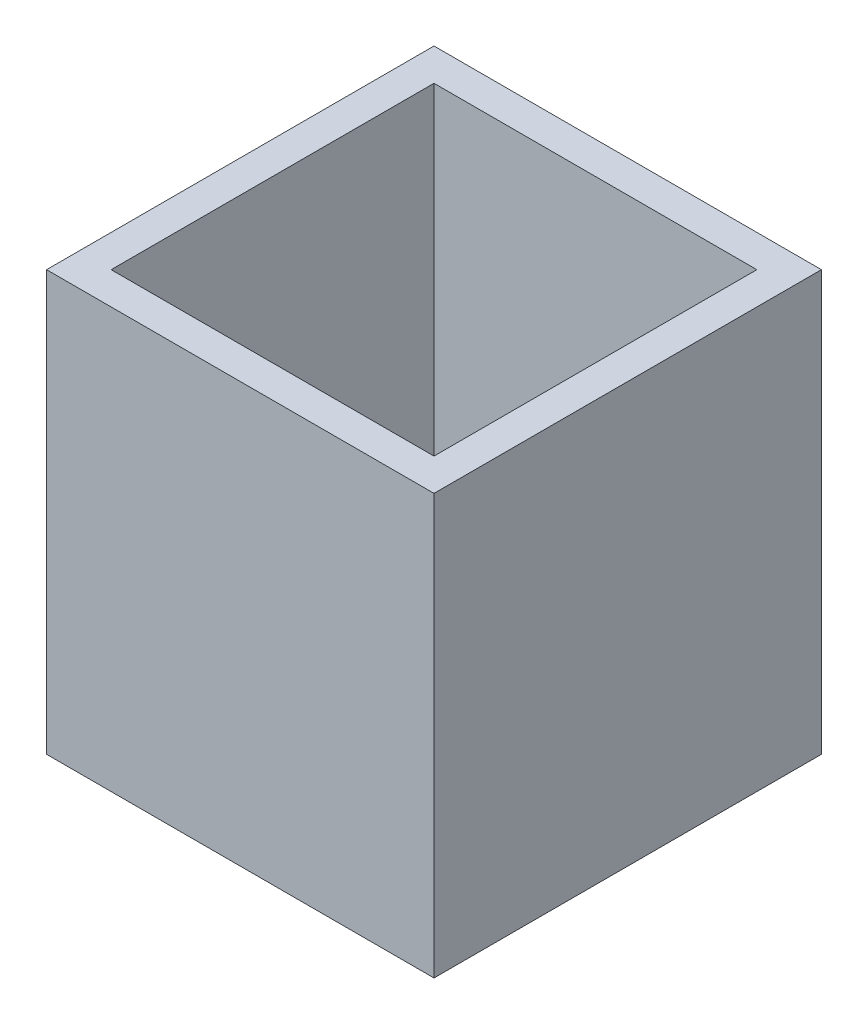
ISO-10303-21;
HEADER;
FILE_DESCRIPTION(('STEP AP214'),'2;1');
FILE_NAME('part.step','',(''),(''),'','','');
FILE_SCHEMA(('AUTOMOTIVE_DESIGN { 1 0 10303 214 1 1 1 1 }'));
ENDSEC;
DATA;
#1=APPLICATION_CONTEXT('core data for automotive mechanical design processes');
#2=APPLICATION_PROTOCOL_DEFINITION('international standard','automotive_design',2000,#1);
#3=PRODUCT_CONTEXT('',#1,'mechanical');
#4=PRODUCT('Part','Part','',(#3));
#5=PRODUCT_RELATED_PRODUCT_CATEGORY('part','',(#4));
#6=PRODUCT_DEFINITION_FORMATION('','',#4);
#7=PRODUCT_DEFINITION_CONTEXT('part definition',#1,'design');
#8=PRODUCT_DEFINITION('design','',#6,#7);
#9=PRODUCT_DEFINITION_SHAPE('','',#8);
#10=(LENGTH_UNIT() NAMED_UNIT(*) SI_UNIT(.MILLI.,.METRE.));
#11=(NAMED_UNIT(*) PLANE_ANGLE_UNIT() SI_UNIT($,.RADIAN.));
#12=(NAMED_UNIT(*) SI_UNIT($,.STERADIAN.) SOLID_ANGLE_UNIT());
#13=UNCERTAINTY_MEASURE_WITH_UNIT(LENGTH_MEASURE(1.E-05),#10,'distance_accuracy_value','');
#14=(GEOMETRIC_REPRESENTATION_CONTEXT(3) GLOBAL_UNCERTAINTY_ASSIGNED_CONTEXT((#13)) GLOBAL_UNIT_ASSIGNED_CONTEXT((#10,
#11,#12)) REPRESENTATION_CONTEXT('',''));
#15=CARTESIAN_POINT('',(0.,0.,0.));
#16=DIRECTION('',(0.,0.,1.));
#17=DIRECTION('',(1.,0.,0.));
#18=AXIS2_PLACEMENT_3D('',#15,#16,#17);
#19=CARTESIAN_POINT('',(0.,60.,0.));
#20=DIRECTION('',(0.,-1.,0.));
#21=DIRECTION('',(0.,0.,-1.));
#22=AXIS2_PLACEMENT_3D('',#19,#20,#21);
#23=PLANE('',#22);
#24=DIRECTION('',(0.,0.,-1.));
#25=VECTOR('',#24,1.);
#26=CARTESIAN_POINT('',(30.,60.,30.));
#27=LINE('',#26,#25);
#28=CARTESIAN_POINT('',(30.,60.,30.));
#29=VERTEX_POINT('',#28);
#30=CARTESIAN_POINT('',(30.,60.,-30.));
#31=VERTEX_POINT('',#30);
#32=EDGE_CURVE('E106',#29,#31,#27,.T.);
#33=ORIENTED_EDGE('',*,*,#32,.T.);
#34=DIRECTION('',(-1.,0.,0.));
#35=VECTOR('',#34,1.);
#36=CARTESIAN_POINT('',(-30.,60.,-30.));
#37=LINE('',#36,#35);
#38=CARTESIAN_POINT('',(-30.,60.,-30.));
#39=VERTEX_POINT('',#38);
#40=EDGE_CURVE('E162',#31,#39,#37,.T.);
#41=ORIENTED_EDGE('',*,*,#40,.T.);
#42=DIRECTION('',(0.,0.,1.));
#43=VECTOR('',#42,1.);
#44=CARTESIAN_POINT('',(-30.,60.,30.));
#45=LINE('',#44,#43);
#46=CARTESIAN_POINT('',(-30.,60.,30.));
#47=VERTEX_POINT('',#46);
#48=EDGE_CURVE('E164',#39,#47,#45,.T.);
#49=ORIENTED_EDGE('',*,*,#48,.T.);
#50=DIRECTION('',(1.,0.,0.));
#51=VECTOR('',#50,1.);
#52=CARTESIAN_POINT('',(-30.,60.,30.));
#53=LINE('',#52,#51);
#54=EDGE_CURVE('E110',#47,#29,#53,.T.);
#55=ORIENTED_EDGE('',*,*,#54,.T.);
#56=EDGE_LOOP('',(#33,#41,#49,#55));
#57=FACE_BOUND('',#56,.T.);
#58=DIRECTION('',(0.,0.,-1.));
#59=VECTOR('',#58,1.);
#60=CARTESIAN_POINT('',(25.,60.,25.));
#61=LINE('',#60,#59);
#62=CARTESIAN_POINT('',(25.,60.,25.));
#63=VERTEX_POINT('',#62);
#64=CARTESIAN_POINT('',(25.,60.,-25.));
#65=VERTEX_POINT('',#64);
#66=EDGE_CURVE('E136',#63,#65,#61,.T.);
#67=ORIENTED_EDGE('',*,*,#66,.F.);
#68=DIRECTION('',(1.,0.,0.));
#69=VECTOR('',#68,1.);
#70=CARTESIAN_POINT('',(-25.,60.,25.));
#71=LINE('',#70,#69);
#72=CARTESIAN_POINT('',(-25.,60.,25.));
#73=VERTEX_POINT('',#72);
#74=EDGE_CURVE('E143',#73,#63,#71,.T.);
#75=ORIENTED_EDGE('',*,*,#74,.F.);
#76=DIRECTION('',(0.,0.,1.));
#77=VECTOR('',#76,1.);
#78=CARTESIAN_POINT('',(-25.,60.,25.));
#79=LINE('',#78,#77);
#80=CARTESIAN_POINT('',(-25.,60.,-25.));
#81=VERTEX_POINT('',#80);
#82=EDGE_CURVE('E141',#81,#73,#79,.T.);
#83=ORIENTED_EDGE('',*,*,#82,.F.);
#84=DIRECTION('',(-1.,0.,0.));
#85=VECTOR('',#84,1.);
#86=CARTESIAN_POINT('',(-25.,60.,-25.));
#87=LINE('',#86,#85);
#88=EDGE_CURVE('E138',#65,#81,#87,.T.);
#89=ORIENTED_EDGE('',*,*,#88,.F.);
#90=EDGE_LOOP('',(#67,#75,#83,#89));
#91=FACE_BOUND('',#90,.T.);
#92=ADVANCED_FACE('F33',(#57,#91),#23,.F.);
#93=CARTESIAN_POINT('',(30.,60.,30.));
#94=DIRECTION('',(-1.,0.,0.));
#95=DIRECTION('',(0.,0.,1.));
#96=AXIS2_PLACEMENT_3D('',#93,#94,#95);
#97=PLANE('',#96);
#98=DIRECTION('',(0.,-1.,0.));
#99=VECTOR('',#98,1.);
#100=CARTESIAN_POINT('',(30.,60.,30.));
#101=LINE('',#100,#99);
#102=CARTESIAN_POINT('',(30.,-5.,30.));
#103=VERTEX_POINT('',#102);
#104=EDGE_CURVE('E100',#29,#103,#101,.T.);
#105=ORIENTED_EDGE('',*,*,#104,.T.);
#106=DIRECTION('',(0.,0.,1.));
#107=VECTOR('',#106,1.);
#108=CARTESIAN_POINT('',(30.,-5.,-30.));
#109=LINE('',#108,#107);
#110=CARTESIAN_POINT('',(30.,-5.,-30.));
#111=VERTEX_POINT('',#110);
#112=EDGE_CURVE('E104',#111,#103,#109,.T.);
#113=ORIENTED_EDGE('',*,*,#112,.F.);
#114=DIRECTION('',(0.,-1.,0.));
#115=VECTOR('',#114,1.);
#116=CARTESIAN_POINT('',(30.,60.,-30.));
#117=LINE('',#116,#115);
#118=EDGE_CURVE('E11',#31,#111,#117,.T.);
#119=ORIENTED_EDGE('',*,*,#118,.F.);
#120=ORIENTED_EDGE('',*,*,#32,.F.);
#121=EDGE_LOOP('',(#105,#113,#119,#120));
#122=FACE_BOUND('',#121,.T.);
#123=ADVANCED_FACE('F35',(#122),#97,.F.);
#124=CARTESIAN_POINT('',(-30.,60.,-30.));
#125=DIRECTION('',(0.,0.,1.));
#126=DIRECTION('',(1.,0.,0.));
#127=AXIS2_PLACEMENT_3D('',#124,#125,#126);
#128=PLANE('',#127);
#129=CARTESIAN_POINT('',(13.1765280058509,8.1,-30.));
#130=DIRECTION('',(0.,0.,-1.));
#131=DIRECTION('',(-1.,0.,0.));
#132=AXIS2_PLACEMENT_3D('',#129,#130,#131);
#133=CIRCLE('',#132,1.25);
#134=CARTESIAN_POINT('',(11.9265280058509,8.1,-30.));
#135=VERTEX_POINT('',#134);
#136=EDGE_CURVE('E218',#135,#135,#133,.T.);
#137=ORIENTED_EDGE('',*,*,#136,.F.);
#138=EDGE_LOOP('',(#137));
#139=FACE_BOUND('',#138,.T.);
#140=CARTESIAN_POINT('',(0.,2.5,-30.));
#141=DIRECTION('',(0.,0.,-1.));
#142=DIRECTION('',(-1.,0.,0.));
#143=AXIS2_PLACEMENT_3D('',#140,#141,#142);
#144=CIRCLE('',#143,1.25);
#145=CARTESIAN_POINT('',(-1.24999999999999,2.5,-30.));
#146=VERTEX_POINT('',#145);
#147=EDGE_CURVE('E128',#146,#146,#144,.T.);
#148=ORIENTED_EDGE('',*,*,#147,.F.);
#149=EDGE_LOOP('',(#148));
#150=FACE_BOUND('',#149,.T.);
#151=CARTESIAN_POINT('',(0.,8.1,-30.));
#152=DIRECTION('',(0.,0.,-1.));
#153=DIRECTION('',(-1.,0.,0.));
#154=AXIS2_PLACEMENT_3D('',#151,#152,#153);
#155=CIRCLE('',#154,1.25);
#156=CARTESIAN_POINT('',(-1.24999999999999,8.1,-30.));
#157=VERTEX_POINT('',#156);
#158=EDGE_CURVE('E224',#157,#157,#155,.T.);
#159=ORIENTED_EDGE('',*,*,#158,.F.);
#160=EDGE_LOOP('',(#159));
#161=FACE_BOUND('',#160,.T.);
#162=ORIENTED_EDGE('',*,*,#118,.T.);
#163=DIRECTION('',(1.,0.,0.));
#164=VECTOR('',#163,1.);
#165=CARTESIAN_POINT('',(-30.,-5.,-30.));
#166=LINE('',#165,#164);
#167=CARTESIAN_POINT('',(-30.,-5.,-30.));
#168=VERTEX_POINT('',#167);
#169=EDGE_CURVE('E124',#168,#111,#166,.T.);
#170=ORIENTED_EDGE('',*,*,#169,.F.);
#171=DIRECTION('',(0.,-1.,0.));
#172=VECTOR('',#171,1.);
#173=CARTESIAN_POINT('',(-30.,60.,-30.));
#174=LINE('',#173,#172);
#175=EDGE_CURVE('E41',#39,#168,#174,.T.);
#176=ORIENTED_EDGE('',*,*,#175,.F.);
#177=ORIENTED_EDGE('',*,*,#40,.F.);
#178=EDGE_LOOP('',(#162,#170,#176,#177));
#179=FACE_BOUND('',#178,.T.);
#180=ADVANCED_FACE('F172',(#139,#150,#161,#179),#128,.F.);
#181=CARTESIAN_POINT('',(-30.,60.,30.));
#182=DIRECTION('',(1.,0.,0.));
#183=DIRECTION('',(0.,0.,-1.));
#184=AXIS2_PLACEMENT_3D('',#181,#182,#183);
#185=PLANE('',#184);
#186=ORIENTED_EDGE('',*,*,#175,.T.);
#187=DIRECTION('',(0.,0.,-1.));
#188=VECTOR('',#187,1.);
#189=CARTESIAN_POINT('',(-30.,-5.,-30.));
#190=LINE('',#189,#188);
#191=CARTESIAN_POINT('',(-30.,-5.,30.));
#192=VERTEX_POINT('',#191);
#193=EDGE_CURVE('E119',#192,#168,#190,.T.);
#194=ORIENTED_EDGE('',*,*,#193,.F.);
#195=DIRECTION('',(0.,-1.,0.));
#196=VECTOR('',#195,1.);
#197=CARTESIAN_POINT('',(-30.,60.,30.));
#198=LINE('',#197,#196);
#199=EDGE_CURVE('E109',#47,#192,#198,.T.);
#200=ORIENTED_EDGE('',*,*,#199,.F.);
#201=ORIENTED_EDGE('',*,*,#48,.F.);
#202=EDGE_LOOP('',(#186,#194,#200,#201));
#203=FACE_BOUND('',#202,.T.);
#204=ADVANCED_FACE('F170',(#203),#185,.F.);
#205=CARTESIAN_POINT('',(-30.,60.,30.));
#206=DIRECTION('',(0.,0.,-1.));
#207=DIRECTION('',(-1.,0.,0.));
#208=AXIS2_PLACEMENT_3D('',#205,#206,#207);
#209=PLANE('',#208);
#210=ORIENTED_EDGE('',*,*,#199,.T.);
#211=DIRECTION('',(-1.,0.,0.));
#212=VECTOR('',#211,1.);
#213=CARTESIAN_POINT('',(-30.,-5.,30.));
#214=LINE('',#213,#212);
#215=EDGE_CURVE('E113',#103,#192,#214,.T.);
#216=ORIENTED_EDGE('',*,*,#215,.F.);
#217=ORIENTED_EDGE('',*,*,#104,.F.);
#218=ORIENTED_EDGE('',*,*,#54,.F.);
#219=EDGE_LOOP('',(#210,#216,#217,#218));
#220=FACE_BOUND('',#219,.T.);
#221=ADVANCED_FACE('F114',(#220),#209,.F.);
#222=CARTESIAN_POINT('',(25.,60.,25.));
#223=DIRECTION('',(-1.,0.,0.));
#224=DIRECTION('',(0.,0.,1.));
#225=AXIS2_PLACEMENT_3D('',#222,#223,#224);
#226=PLANE('',#225);
#227=DIRECTION('',(0.,0.,-1.));
#228=VECTOR('',#227,1.);
#229=CARTESIAN_POINT('',(25.,0.,25.));
#230=LINE('',#229,#228);
#231=CARTESIAN_POINT('',(25.,0.,25.));
#232=VERTEX_POINT('',#231);
#233=CARTESIAN_POINT('',(25.,0.,-25.));
#234=VERTEX_POINT('',#233);
#235=EDGE_CURVE('E56',#232,#234,#230,.T.);
#236=ORIENTED_EDGE('',*,*,#235,.F.);
#237=DIRECTION('',(0.,-1.,0.));
#238=VECTOR('',#237,1.);
#239=CARTESIAN_POINT('',(25.,60.,25.));
#240=LINE('',#239,#238);
#241=EDGE_CURVE('E145',#63,#232,#240,.T.);
#242=ORIENTED_EDGE('',*,*,#241,.F.);
#243=ORIENTED_EDGE('',*,*,#66,.T.);
#244=DIRECTION('',(0.,-1.,0.));
#245=VECTOR('',#244,1.);
#246=CARTESIAN_POINT('',(25.,60.,-25.));
#247=LINE('',#246,#245);
#248=EDGE_CURVE('E159',#65,#234,#247,.T.);
#249=ORIENTED_EDGE('',*,*,#248,.T.);
#250=EDGE_LOOP('',(#236,#242,#243,#249));
#251=FACE_BOUND('',#250,.T.);
#252=ADVANCED_FACE('F182',(#251),#226,.T.);
#253=CARTESIAN_POINT('',(-25.,60.,-25.));
#254=DIRECTION('',(0.,0.,1.));
#255=DIRECTION('',(1.,0.,0.));
#256=AXIS2_PLACEMENT_3D('',#253,#254,#255);
#257=PLANE('',#256);
#258=CARTESIAN_POINT('',(13.1765280058509,8.1,-25.));
#259=DIRECTION('',(0.,0.,1.));
#260=DIRECTION('',(1.,0.,0.));
#261=AXIS2_PLACEMENT_3D('',#258,#259,#260);
#262=CIRCLE('',#261,1.25);
#263=CARTESIAN_POINT('',(14.4265280058509,8.1,-25.));
#264=VERTEX_POINT('',#263);
#265=EDGE_CURVE('E227',#264,#264,#262,.F.);
#266=ORIENTED_EDGE('',*,*,#265,.T.);
#267=EDGE_LOOP('',(#266));
#268=FACE_BOUND('',#267,.T.);
#269=CARTESIAN_POINT('',(0.,2.5,-25.));
#270=DIRECTION('',(0.,0.,1.));
#271=DIRECTION('',(1.,0.,0.));
#272=AXIS2_PLACEMENT_3D('',#269,#270,#271);
#273=CIRCLE('',#272,1.25);
#274=CARTESIAN_POINT('',(1.25000000000001,2.5,-25.));
#275=VERTEX_POINT('',#274);
#276=EDGE_CURVE('E125',#275,#275,#273,.F.);
#277=ORIENTED_EDGE('',*,*,#276,.T.);
#278=EDGE_LOOP('',(#277));
#279=FACE_BOUND('',#278,.T.);
#280=CARTESIAN_POINT('',(0.,8.1,-25.));
#281=DIRECTION('',(0.,0.,1.));
#282=DIRECTION('',(1.,0.,0.));
#283=AXIS2_PLACEMENT_3D('',#280,#281,#282);
#284=CIRCLE('',#283,1.25);
#285=CARTESIAN_POINT('',(1.25000000000001,8.1,-25.));
#286=VERTEX_POINT('',#285);
#287=EDGE_CURVE('E131',#286,#286,#284,.F.);
#288=ORIENTED_EDGE('',*,*,#287,.T.);
#289=EDGE_LOOP('',(#288));
#290=FACE_BOUND('',#289,.T.);
#291=DIRECTION('',(-1.,0.,0.));
#292=VECTOR('',#291,1.);
#293=CARTESIAN_POINT('',(-25.,0.,-25.));
#294=LINE('',#293,#292);
#295=CARTESIAN_POINT('',(-25.,0.,-25.));
#296=VERTEX_POINT('',#295);
#297=EDGE_CURVE('E147',#234,#296,#294,.T.);
#298=ORIENTED_EDGE('',*,*,#297,.F.);
#299=ORIENTED_EDGE('',*,*,#248,.F.);
#300=ORIENTED_EDGE('',*,*,#88,.T.);
#301=DIRECTION('',(0.,-1.,0.));
#302=VECTOR('',#301,1.);
#303=CARTESIAN_POINT('',(-25.,60.,-25.));
#304=LINE('',#303,#302);
#305=EDGE_CURVE('E157',#81,#296,#304,.T.);
#306=ORIENTED_EDGE('',*,*,#305,.T.);
#307=EDGE_LOOP('',(#298,#299,#300,#306));
#308=FACE_BOUND('',#307,.T.);
#309=ADVANCED_FACE('F184',(#268,#279,#290,#308),#257,.T.);
#310=CARTESIAN_POINT('',(-25.,60.,25.));
#311=DIRECTION('',(1.,0.,0.));
#312=DIRECTION('',(0.,0.,-1.));
#313=AXIS2_PLACEMENT_3D('',#310,#311,#312);
#314=PLANE('',#313);
#315=DIRECTION('',(0.,0.,1.));
#316=VECTOR('',#315,1.);
#317=CARTESIAN_POINT('',(-25.,0.,25.));
#318=LINE('',#317,#316);
#319=CARTESIAN_POINT('',(-25.,0.,25.));
#320=VERTEX_POINT('',#319);
#321=EDGE_CURVE('E150',#296,#320,#318,.T.);
#322=ORIENTED_EDGE('',*,*,#321,.F.);
#323=ORIENTED_EDGE('',*,*,#305,.F.);
#324=ORIENTED_EDGE('',*,*,#82,.T.);
#325=DIRECTION('',(0.,-1.,0.));
#326=VECTOR('',#325,1.);
#327=CARTESIAN_POINT('',(-25.,60.,25.));
#328=LINE('',#327,#326);
#329=EDGE_CURVE('E48',#73,#320,#328,.T.);
#330=ORIENTED_EDGE('',*,*,#329,.T.);
#331=EDGE_LOOP('',(#322,#323,#324,#330));
#332=FACE_BOUND('',#331,.T.);
#333=ADVANCED_FACE('F191',(#332),#314,.T.);
#334=CARTESIAN_POINT('',(-25.,60.,25.));
#335=DIRECTION('',(0.,0.,-1.));
#336=DIRECTION('',(-1.,0.,0.));
#337=AXIS2_PLACEMENT_3D('',#334,#335,#336);
#338=PLANE('',#337);
#339=DIRECTION('',(1.,0.,0.));
#340=VECTOR('',#339,1.);
#341=CARTESIAN_POINT('',(-25.,0.,25.));
#342=LINE('',#341,#340);
#343=EDGE_CURVE('E139',#320,#232,#342,.T.);
#344=ORIENTED_EDGE('',*,*,#343,.F.);
#345=ORIENTED_EDGE('',*,*,#329,.F.);
#346=ORIENTED_EDGE('',*,*,#74,.T.);
#347=ORIENTED_EDGE('',*,*,#241,.T.);
#348=EDGE_LOOP('',(#344,#345,#346,#347));
#349=FACE_BOUND('',#348,.T.);
#350=ADVANCED_FACE('F189',(#349),#338,.T.);
#351=CARTESIAN_POINT('',(0.,0.,0.));
#352=DIRECTION('',(0.,1.,0.));
#353=DIRECTION('',(0.,0.,1.));
#354=AXIS2_PLACEMENT_3D('',#351,#352,#353);
#355=PLANE('',#354);
#356=ORIENTED_EDGE('',*,*,#321,.T.);
#357=ORIENTED_EDGE('',*,*,#343,.T.);
#358=ORIENTED_EDGE('',*,*,#235,.T.);
#359=ORIENTED_EDGE('',*,*,#297,.T.);
#360=EDGE_LOOP('',(#356,#357,#358,#359));
#361=FACE_BOUND('',#360,.T.);
#362=ADVANCED_FACE('F188',(#361),#355,.T.);
#363=CARTESIAN_POINT('',(0.,-5.,0.));
#364=DIRECTION('',(0.,1.,0.));
#365=DIRECTION('',(0.,0.,1.));
#366=AXIS2_PLACEMENT_3D('',#363,#364,#365);
#367=PLANE('',#366);
#368=ORIENTED_EDGE('',*,*,#112,.T.);
#369=ORIENTED_EDGE('',*,*,#215,.T.);
#370=ORIENTED_EDGE('',*,*,#193,.T.);
#371=ORIENTED_EDGE('',*,*,#169,.T.);
#372=EDGE_LOOP('',(#368,#369,#370,#371));
#373=FACE_BOUND('',#372,.T.);
#374=ADVANCED_FACE('F122',(#373),#367,.F.);
#375=CARTESIAN_POINT('',(0.,8.1,-21.4644660940673));
#376=DIRECTION('',(0.,0.,-1.));
#377=DIRECTION('',(-1.,0.,0.));
#378=AXIS2_PLACEMENT_3D('',#375,#376,#377);
#379=CYLINDRICAL_SURFACE('',#378,1.25);
#380=ORIENTED_EDGE('',*,*,#158,.T.);
#381=EDGE_LOOP('',(#380));
#382=FACE_BOUND('',#381,.T.);
#383=ORIENTED_EDGE('',*,*,#287,.F.);
#384=EDGE_LOOP('',(#383));
#385=FACE_BOUND('',#384,.T.);
#386=ADVANCED_FACE('F243',(#382,#385),#379,.F.);
#387=CARTESIAN_POINT('',(0.,2.5,-21.4644660940673));
#388=DIRECTION('',(0.,0.,-1.));
#389=DIRECTION('',(-1.,0.,0.));
#390=AXIS2_PLACEMENT_3D('',#387,#388,#389);
#391=CYLINDRICAL_SURFACE('',#390,1.25);
#392=ORIENTED_EDGE('',*,*,#147,.T.);
#393=EDGE_LOOP('',(#392));
#394=FACE_BOUND('',#393,.T.);
#395=ORIENTED_EDGE('',*,*,#276,.F.);
#396=EDGE_LOOP('',(#395));
#397=FACE_BOUND('',#396,.T.);
#398=ADVANCED_FACE('F238',(#394,#397),#391,.F.);
#399=CARTESIAN_POINT('',(13.1765280058509,8.1,30.001));
#400=DIRECTION('',(0.,0.,-1.));
#401=DIRECTION('',(-1.,0.,0.));
#402=AXIS2_PLACEMENT_3D('',#399,#400,#401);
#403=CYLINDRICAL_SURFACE('',#402,1.25);
#404=ORIENTED_EDGE('',*,*,#265,.F.);
#405=EDGE_LOOP('',(#404));
#406=FACE_BOUND('',#405,.T.);
#407=ORIENTED_EDGE('',*,*,#136,.T.);
#408=EDGE_LOOP('',(#407));
#409=FACE_BOUND('',#408,.T.);
#410=ADVANCED_FACE('F235',(#406,#409),#403,.F.);
#411=CLOSED_SHELL('',(#92,#123,#180,#204,#221,#252,#309,#333,#350,#362,#374,#386,#398,#410));
#412=MANIFOLD_SOLID_BREP('B2',#411);
#413=ADVANCED_BREP_SHAPE_REPRESENTATION('',(#18,#412),#14);
#414=SHAPE_DEFINITION_REPRESENTATION(#9,#413);
ENDSEC;
END-ISO-10303-21;
